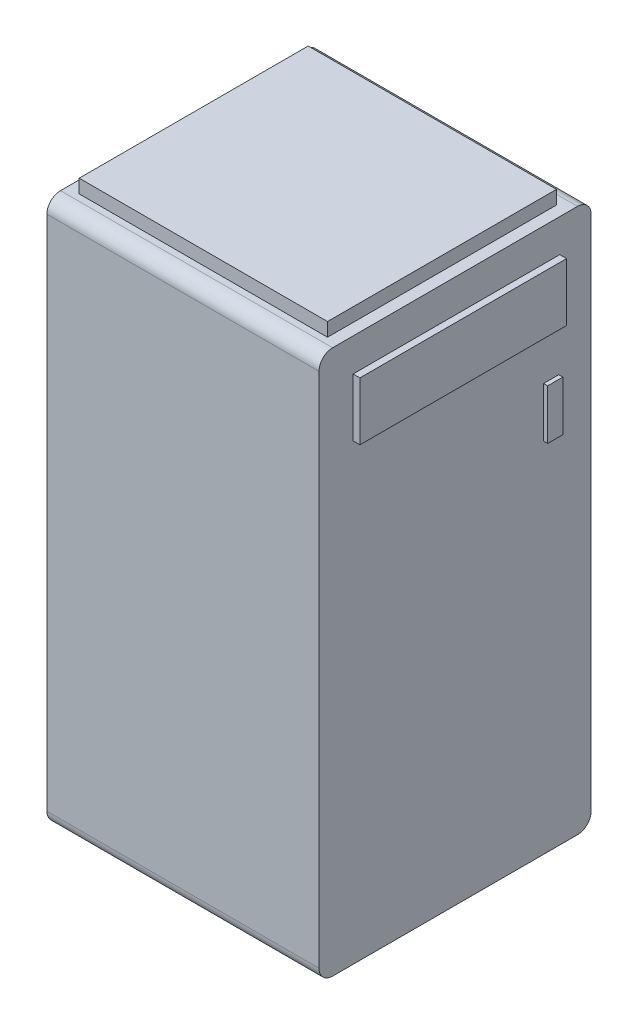
ISO-10303-21;
HEADER;
FILE_DESCRIPTION(('STEP AP214'),'2;1');
FILE_NAME('part.step','',(''),(''),'','','');
FILE_SCHEMA(('AUTOMOTIVE_DESIGN { 1 0 10303 214 1 1 1 1 }'));
ENDSEC;
DATA;
#1=APPLICATION_CONTEXT('core data for automotive mechanical design processes');
#2=APPLICATION_PROTOCOL_DEFINITION('international standard','automotive_design',2000,#1);
#3=PRODUCT_CONTEXT('',#1,'mechanical');
#4=PRODUCT('Part','Part','',(#3));
#5=PRODUCT_RELATED_PRODUCT_CATEGORY('part','',(#4));
#6=PRODUCT_DEFINITION_FORMATION('','',#4);
#7=PRODUCT_DEFINITION_CONTEXT('part definition',#1,'design');
#8=PRODUCT_DEFINITION('design','',#6,#7);
#9=PRODUCT_DEFINITION_SHAPE('','',#8);
#10=(LENGTH_UNIT() NAMED_UNIT(*) SI_UNIT(.MILLI.,.METRE.));
#11=(NAMED_UNIT(*) PLANE_ANGLE_UNIT() SI_UNIT($,.RADIAN.));
#12=(NAMED_UNIT(*) SI_UNIT($,.STERADIAN.) SOLID_ANGLE_UNIT());
#13=UNCERTAINTY_MEASURE_WITH_UNIT(LENGTH_MEASURE(1.E-05),#10,'distance_accuracy_value','');
#14=(GEOMETRIC_REPRESENTATION_CONTEXT(3) GLOBAL_UNCERTAINTY_ASSIGNED_CONTEXT((#13)) GLOBAL_UNIT_ASSIGNED_CONTEXT((#10,
#11,#12)) REPRESENTATION_CONTEXT('',''));
#15=CARTESIAN_POINT('',(0.,0.,0.));
#16=DIRECTION('',(0.,0.,1.));
#17=DIRECTION('',(1.,0.,0.));
#18=AXIS2_PLACEMENT_3D('',#15,#16,#17);
#19=CARTESIAN_POINT('',(-191.055978456742,410.,-14.8091660049622));
#20=DIRECTION('',(1.,0.,0.));
#21=DIRECTION('',(0.,0.,-1.));
#22=AXIS2_PLACEMENT_3D('',#19,#20,#21);
#23=PLANE('',#22);
#24=DIRECTION('',(0.,0.,1.));
#25=VECTOR('',#24,1.);
#26=CARTESIAN_POINT('',(-191.055978456742,400.,-14.8091660049622));
#27=LINE('',#26,#25);
#28=CARTESIAN_POINT('',(-191.055978456742,400.,-183.083294301138));
#29=VERTEX_POINT('',#28);
#30=CARTESIAN_POINT('',(-191.055978456742,400.,-14.8091660049622));
#31=VERTEX_POINT('',#30);
#32=EDGE_CURVE('E106',#29,#31,#27,.T.);
#33=ORIENTED_EDGE('',*,*,#32,.T.);
#34=DIRECTION('',(0.,-1.,0.));
#35=VECTOR('',#34,1.);
#36=CARTESIAN_POINT('',(-191.055978456742,410.,-14.8091660049622));
#37=LINE('',#36,#35);
#38=CARTESIAN_POINT('',(-191.055978456742,410.,-14.8091660049622));
#39=VERTEX_POINT('',#38);
#40=EDGE_CURVE('E12',#39,#31,#37,.T.);
#41=ORIENTED_EDGE('',*,*,#40,.F.);
#42=DIRECTION('',(0.,0.,1.));
#43=VECTOR('',#42,1.);
#44=CARTESIAN_POINT('',(-191.055978456742,410.,-14.8091660049622));
#45=LINE('',#44,#43);
#46=CARTESIAN_POINT('',(-191.055978456742,410.,-183.083294301138));
#47=VERTEX_POINT('',#46);
#48=EDGE_CURVE('E94',#47,#39,#45,.T.);
#49=ORIENTED_EDGE('',*,*,#48,.F.);
#50=DIRECTION('',(0.,-1.,0.));
#51=VECTOR('',#50,1.);
#52=CARTESIAN_POINT('',(-191.055978456742,410.,-183.083294301138));
#53=LINE('',#52,#51);
#54=EDGE_CURVE('E102',#47,#29,#53,.T.);
#55=ORIENTED_EDGE('',*,*,#54,.T.);
#56=EDGE_LOOP('',(#33,#41,#49,#55));
#57=FACE_BOUND('',#56,.T.);
#58=ADVANCED_FACE('F43',(#57),#23,.F.);
#59=CARTESIAN_POINT('',(-8.56084839935853,410.,-14.8091660049622));
#60=DIRECTION('',(0.,0.,-1.));
#61=DIRECTION('',(-1.,0.,0.));
#62=AXIS2_PLACEMENT_3D('',#59,#60,#61);
#63=PLANE('',#62);
#64=DIRECTION('',(1.,0.,0.));
#65=VECTOR('',#64,1.);
#66=CARTESIAN_POINT('',(-8.56084839935853,400.,-14.8091660049622));
#67=LINE('',#66,#65);
#68=CARTESIAN_POINT('',(-8.56084839935853,400.,-14.8091660049622));
#69=VERTEX_POINT('',#68);
#70=EDGE_CURVE('E98',#31,#69,#67,.T.);
#71=ORIENTED_EDGE('',*,*,#70,.T.);
#72=DIRECTION('',(0.,-1.,0.));
#73=VECTOR('',#72,1.);
#74=CARTESIAN_POINT('',(-8.56084839935853,410.,-14.8091660049622));
#75=LINE('',#74,#73);
#76=CARTESIAN_POINT('',(-8.56084839935853,410.,-14.8091660049622));
#77=VERTEX_POINT('',#76);
#78=EDGE_CURVE('E51',#77,#69,#75,.T.);
#79=ORIENTED_EDGE('',*,*,#78,.F.);
#80=DIRECTION('',(1.,0.,0.));
#81=VECTOR('',#80,1.);
#82=CARTESIAN_POINT('',(-8.56084839935853,410.,-14.8091660049622));
#83=LINE('',#82,#81);
#84=EDGE_CURVE('E89',#39,#77,#83,.T.);
#85=ORIENTED_EDGE('',*,*,#84,.F.);
#86=ORIENTED_EDGE('',*,*,#40,.T.);
#87=EDGE_LOOP('',(#71,#79,#85,#86));
#88=FACE_BOUND('',#87,.T.);
#89=ADVANCED_FACE('F97',(#88),#63,.F.);
#90=CARTESIAN_POINT('',(-8.56084839935853,410.,-183.083294301138));
#91=DIRECTION('',(-1.,0.,0.));
#92=DIRECTION('',(0.,0.,1.));
#93=AXIS2_PLACEMENT_3D('',#90,#91,#92);
#94=PLANE('',#93);
#95=DIRECTION('',(0.,0.,-1.));
#96=VECTOR('',#95,1.);
#97=CARTESIAN_POINT('',(-8.56084839935853,400.,-183.083294301138));
#98=LINE('',#97,#96);
#99=CARTESIAN_POINT('',(-8.56084839935853,400.,-183.083294301138));
#100=VERTEX_POINT('',#99);
#101=EDGE_CURVE('E76',#69,#100,#98,.T.);
#102=ORIENTED_EDGE('',*,*,#101,.T.);
#103=DIRECTION('',(0.,-1.,0.));
#104=VECTOR('',#103,1.);
#105=CARTESIAN_POINT('',(-8.56084839935853,410.,-183.083294301138));
#106=LINE('',#105,#104);
#107=CARTESIAN_POINT('',(-8.56084839935853,410.,-183.083294301138));
#108=VERTEX_POINT('',#107);
#109=EDGE_CURVE('E99',#108,#100,#106,.T.);
#110=ORIENTED_EDGE('',*,*,#109,.F.);
#111=DIRECTION('',(0.,0.,-1.));
#112=VECTOR('',#111,1.);
#113=CARTESIAN_POINT('',(-8.56084839935853,410.,-183.083294301138));
#114=LINE('',#113,#112);
#115=EDGE_CURVE('E92',#77,#108,#114,.T.);
#116=ORIENTED_EDGE('',*,*,#115,.F.);
#117=ORIENTED_EDGE('',*,*,#78,.T.);
#118=EDGE_LOOP('',(#102,#110,#116,#117));
#119=FACE_BOUND('',#118,.T.);
#120=ADVANCED_FACE('F100',(#119),#94,.F.);
#121=CARTESIAN_POINT('',(-191.055978456742,410.,-183.083294301138));
#122=DIRECTION('',(0.,0.,1.));
#123=DIRECTION('',(1.,0.,0.));
#124=AXIS2_PLACEMENT_3D('',#121,#122,#123);
#125=PLANE('',#124);
#126=DIRECTION('',(-1.,0.,0.));
#127=VECTOR('',#126,1.);
#128=CARTESIAN_POINT('',(-191.055978456742,400.,-183.083294301138));
#129=LINE('',#128,#127);
#130=EDGE_CURVE('E82',#100,#29,#129,.T.);
#131=ORIENTED_EDGE('',*,*,#130,.T.);
#132=ORIENTED_EDGE('',*,*,#54,.F.);
#133=DIRECTION('',(-1.,0.,0.));
#134=VECTOR('',#133,1.);
#135=CARTESIAN_POINT('',(-191.055978456742,410.,-183.083294301138));
#136=LINE('',#135,#134);
#137=EDGE_CURVE('E59',#108,#47,#136,.T.);
#138=ORIENTED_EDGE('',*,*,#137,.F.);
#139=ORIENTED_EDGE('',*,*,#109,.T.);
#140=EDGE_LOOP('',(#131,#132,#138,#139));
#141=FACE_BOUND('',#140,.T.);
#142=ADVANCED_FACE('F113',(#141),#125,.F.);
#143=CARTESIAN_POINT('',(0.,410.,0.));
#144=DIRECTION('',(0.,-1.,0.));
#145=DIRECTION('',(0.,0.,-1.));
#146=AXIS2_PLACEMENT_3D('',#143,#144,#145);
#147=PLANE('',#146);
#148=ORIENTED_EDGE('',*,*,#48,.T.);
#149=ORIENTED_EDGE('',*,*,#84,.T.);
#150=ORIENTED_EDGE('',*,*,#115,.T.);
#151=ORIENTED_EDGE('',*,*,#137,.T.);
#152=EDGE_LOOP('',(#148,#149,#150,#151));
#153=FACE_BOUND('',#152,.T.);
#154=ADVANCED_FACE('F90',(#153),#147,.F.);
#155=CARTESIAN_POINT('',(0.,400.,0.));
#156=DIRECTION('',(0.,-1.,0.));
#157=DIRECTION('',(0.,0.,-1.));
#158=AXIS2_PLACEMENT_3D('',#155,#156,#157);
#159=PLANE('',#158);
#160=ORIENTED_EDGE('',*,*,#32,.F.);
#161=ORIENTED_EDGE('',*,*,#130,.F.);
#162=ORIENTED_EDGE('',*,*,#101,.F.);
#163=ORIENTED_EDGE('',*,*,#70,.F.);
#164=EDGE_LOOP('',(#160,#161,#162,#163));
#165=FACE_BOUND('',#164,.T.);
#166=ADVANCED_FACE('F116',(#165),#159,.T.);
#167=CLOSED_SHELL('',(#58,#89,#120,#142,#154,#166));
#168=MANIFOLD_SOLID_BREP('B2',#167);
#169=CARTESIAN_POINT('',(0.,400.,0.));
#170=DIRECTION('',(-1.,0.,0.));
#171=DIRECTION('',(0.,0.,1.));
#172=AXIS2_PLACEMENT_3D('',#169,#170,#171);
#173=PLANE('',#172);
#174=DIRECTION('',(0.,-1.,0.));
#175=VECTOR('',#174,1.);
#176=CARTESIAN_POINT('',(0.,375.782116129489,-25.0721801144417));
#177=LINE('',#176,#175);
#178=CARTESIAN_POINT('',(0.,375.782116129489,-25.0721801144417));
#179=VERTEX_POINT('',#178);
#180=CARTESIAN_POINT('',(0.,333.176152062988,-25.0721801144417));
#181=VERTEX_POINT('',#180);
#182=EDGE_CURVE('E405',#179,#181,#177,.T.);
#183=ORIENTED_EDGE('',*,*,#182,.F.);
#184=DIRECTION('',(0.,0.,1.));
#185=VECTOR('',#184,1.);
#186=CARTESIAN_POINT('',(0.,375.782116129489,-25.0721801144417));
#187=LINE('',#186,#185);
#188=CARTESIAN_POINT('',(0.,375.782116129489,-176.962966153307));
#189=VERTEX_POINT('',#188);
#190=EDGE_CURVE('E395',#189,#179,#187,.T.);
#191=ORIENTED_EDGE('',*,*,#190,.F.);
#192=DIRECTION('',(0.,1.,0.));
#193=VECTOR('',#192,1.);
#194=CARTESIAN_POINT('',(0.,375.782116129489,-176.962966153307));
#195=LINE('',#194,#193);
#196=CARTESIAN_POINT('',(0.,333.176152062988,-176.962966153307));
#197=VERTEX_POINT('',#196);
#198=EDGE_CURVE('E399',#197,#189,#195,.T.);
#199=ORIENTED_EDGE('',*,*,#198,.F.);
#200=DIRECTION('',(0.,0.,-1.));
#201=VECTOR('',#200,1.);
#202=CARTESIAN_POINT('',(0.,333.176152062988,-25.0721801144417));
#203=LINE('',#202,#201);
#204=EDGE_CURVE('E402',#181,#197,#203,.T.);
#205=ORIENTED_EDGE('',*,*,#204,.F.);
#206=EDGE_LOOP('',(#183,#191,#199,#205));
#207=FACE_BOUND('',#206,.T.);
#208=DIRECTION('',(0.,0.,-1.));
#209=VECTOR('',#208,1.);
#210=CARTESIAN_POINT('',(0.,0.,0.));
#211=LINE('',#210,#209);
#212=CARTESIAN_POINT('',(0.,0.,-10.));
#213=VERTEX_POINT('',#212);
#214=CARTESIAN_POINT('',(0.,0.,-190.));
#215=VERTEX_POINT('',#214);
#216=EDGE_CURVE('E376',#213,#215,#211,.T.);
#217=ORIENTED_EDGE('',*,*,#216,.T.);
#218=CARTESIAN_POINT('',(0.,10.,-190.));
#219=DIRECTION('',(-1.,0.,0.));
#220=DIRECTION('',(0.,0.,1.));
#221=AXIS2_PLACEMENT_3D('',#218,#219,#220);
#222=CIRCLE('',#221,10.);
#223=CARTESIAN_POINT('',(0.,10.,-200.));
#224=VERTEX_POINT('',#223);
#225=EDGE_CURVE('E315',#215,#224,#222,.F.);
#226=ORIENTED_EDGE('',*,*,#225,.T.);
#227=DIRECTION('',(0.,-1.,0.));
#228=VECTOR('',#227,1.);
#229=CARTESIAN_POINT('',(0.,400.,-200.));
#230=LINE('',#229,#228);
#231=CARTESIAN_POINT('',(0.,390.,-200.));
#232=VERTEX_POINT('',#231);
#233=EDGE_CURVE('E360',#232,#224,#230,.T.);
#234=ORIENTED_EDGE('',*,*,#233,.F.);
#235=CARTESIAN_POINT('',(0.,390.,-190.));
#236=DIRECTION('',(-1.,0.,0.));
#237=DIRECTION('',(0.,0.,1.));
#238=AXIS2_PLACEMENT_3D('',#235,#236,#237);
#239=CIRCLE('',#238,10.);
#240=CARTESIAN_POINT('',(0.,400.,-190.));
#241=VERTEX_POINT('',#240);
#242=EDGE_CURVE('E341',#232,#241,#239,.F.);
#243=ORIENTED_EDGE('',*,*,#242,.T.);
#244=DIRECTION('',(0.,0.,-1.));
#245=VECTOR('',#244,1.);
#246=CARTESIAN_POINT('',(0.,400.,0.));
#247=LINE('',#246,#245);
#248=CARTESIAN_POINT('',(0.,400.,-10.));
#249=VERTEX_POINT('',#248);
#250=EDGE_CURVE('E375',#249,#241,#247,.T.);
#251=ORIENTED_EDGE('',*,*,#250,.F.);
#252=CARTESIAN_POINT('',(0.,390.,-10.));
#253=DIRECTION('',(-1.,0.,0.));
#254=DIRECTION('',(0.,0.,1.));
#255=AXIS2_PLACEMENT_3D('',#252,#253,#254);
#256=CIRCLE('',#255,10.);
#257=CARTESIAN_POINT('',(0.,390.,0.));
#258=VERTEX_POINT('',#257);
#259=EDGE_CURVE('E355',#249,#258,#256,.F.);
#260=ORIENTED_EDGE('',*,*,#259,.T.);
#261=DIRECTION('',(0.,-1.,0.));
#262=VECTOR('',#261,1.);
#263=CARTESIAN_POINT('',(0.,400.,0.));
#264=LINE('',#263,#262);
#265=CARTESIAN_POINT('',(0.,10.,0.));
#266=VERTEX_POINT('',#265);
#267=EDGE_CURVE('E369',#258,#266,#264,.T.);
#268=ORIENTED_EDGE('',*,*,#267,.T.);
#269=CARTESIAN_POINT('',(0.,10.,-10.));
#270=DIRECTION('',(-1.,0.,0.));
#271=DIRECTION('',(0.,0.,1.));
#272=AXIS2_PLACEMENT_3D('',#269,#270,#271);
#273=CIRCLE('',#272,10.);
#274=EDGE_CURVE('E336',#266,#213,#273,.F.);
#275=ORIENTED_EDGE('',*,*,#274,.T.);
#276=EDGE_LOOP('',(#217,#226,#234,#243,#251,#260,#268,#275));
#277=FACE_BOUND('',#276,.T.);
#278=DIRECTION('',(0.,-1.,0.));
#279=VECTOR('',#278,1.);
#280=CARTESIAN_POINT('',(0.,263.02065383153,-165.070356943589));
#281=LINE('',#280,#279);
#282=CARTESIAN_POINT('',(0.,299.716628665272,-165.070356943589));
#283=VERTEX_POINT('',#282);
#284=CARTESIAN_POINT('',(0.,263.02065383153,-165.070356943589));
#285=VERTEX_POINT('',#284);
#286=EDGE_CURVE('E438',#283,#285,#281,.T.);
#287=ORIENTED_EDGE('',*,*,#286,.F.);
#288=DIRECTION('',(0.,0.,1.));
#289=VECTOR('',#288,1.);
#290=CARTESIAN_POINT('',(0.,299.716628665272,-165.070356943589));
#291=LINE('',#290,#289);
#292=CARTESIAN_POINT('',(0.,299.716628665272,-176.24824555006));
#293=VERTEX_POINT('',#292);
#294=EDGE_CURVE('E428',#293,#283,#291,.T.);
#295=ORIENTED_EDGE('',*,*,#294,.F.);
#296=DIRECTION('',(0.,1.,0.));
#297=VECTOR('',#296,1.);
#298=CARTESIAN_POINT('',(0.,299.716628665272,-176.24824555006));
#299=LINE('',#298,#297);
#300=CARTESIAN_POINT('',(0.,263.02065383153,-176.24824555006));
#301=VERTEX_POINT('',#300);
#302=EDGE_CURVE('E432',#301,#293,#299,.T.);
#303=ORIENTED_EDGE('',*,*,#302,.F.);
#304=DIRECTION('',(0.,0.,-1.));
#305=VECTOR('',#304,1.);
#306=CARTESIAN_POINT('',(0.,263.02065383153,-176.24824555006));
#307=LINE('',#306,#305);
#308=EDGE_CURVE('E435',#285,#301,#307,.T.);
#309=ORIENTED_EDGE('',*,*,#308,.F.);
#310=EDGE_LOOP('',(#287,#295,#303,#309));
#311=FACE_BOUND('',#310,.T.);
#312=ADVANCED_FACE('F167',(#207,#277,#311),#173,.F.);
#313=CARTESIAN_POINT('',(0.,400.,-200.));
#314=DIRECTION('',(0.,0.,1.));
#315=DIRECTION('',(1.,0.,0.));
#316=AXIS2_PLACEMENT_3D('',#313,#314,#315);
#317=PLANE('',#316);
#318=ORIENTED_EDGE('',*,*,#233,.T.);
#319=DIRECTION('',(-1.,0.,0.));
#320=VECTOR('',#319,1.);
#321=CARTESIAN_POINT('',(0.,10.,-200.));
#322=LINE('',#321,#320);
#323=CARTESIAN_POINT('',(-200.,10.,-200.));
#324=VERTEX_POINT('',#323);
#325=EDGE_CURVE('E328',#224,#324,#322,.T.);
#326=ORIENTED_EDGE('',*,*,#325,.T.);
#327=DIRECTION('',(0.,-1.,0.));
#328=VECTOR('',#327,1.);
#329=CARTESIAN_POINT('',(-200.,400.,-200.));
#330=LINE('',#329,#328);
#331=CARTESIAN_POINT('',(-200.,390.,-200.));
#332=VERTEX_POINT('',#331);
#333=EDGE_CURVE('E363',#332,#324,#330,.T.);
#334=ORIENTED_EDGE('',*,*,#333,.F.);
#335=DIRECTION('',(-1.,0.,0.));
#336=VECTOR('',#335,1.);
#337=CARTESIAN_POINT('',(0.,390.,-200.));
#338=LINE('',#337,#336);
#339=EDGE_CURVE('E343',#332,#232,#338,.F.);
#340=ORIENTED_EDGE('',*,*,#339,.T.);
#341=EDGE_LOOP('',(#318,#326,#334,#340));
#342=FACE_BOUND('',#341,.T.);
#343=ADVANCED_FACE('F478',(#342),#317,.F.);
#344=CARTESIAN_POINT('',(-200.,400.,0.));
#345=DIRECTION('',(1.,0.,0.));
#346=DIRECTION('',(0.,0.,-1.));
#347=AXIS2_PLACEMENT_3D('',#344,#345,#346);
#348=PLANE('',#347);
#349=ORIENTED_EDGE('',*,*,#333,.T.);
#350=CARTESIAN_POINT('',(-200.,10.,-190.));
#351=DIRECTION('',(1.,0.,0.));
#352=DIRECTION('',(0.,0.,-1.));
#353=AXIS2_PLACEMENT_3D('',#350,#351,#352);
#354=CIRCLE('',#353,10.);
#355=CARTESIAN_POINT('',(-200.,0.,-190.));
#356=VERTEX_POINT('',#355);
#357=EDGE_CURVE('E326',#324,#356,#354,.F.);
#358=ORIENTED_EDGE('',*,*,#357,.T.);
#359=DIRECTION('',(0.,0.,1.));
#360=VECTOR('',#359,1.);
#361=CARTESIAN_POINT('',(-200.,0.,0.));
#362=LINE('',#361,#360);
#363=CARTESIAN_POINT('',(-200.,0.,-9.99999999999998));
#364=VERTEX_POINT('',#363);
#365=EDGE_CURVE('E373',#356,#364,#362,.T.);
#366=ORIENTED_EDGE('',*,*,#365,.T.);
#367=CARTESIAN_POINT('',(-200.,10.,-9.99999999999998));
#368=DIRECTION('',(1.,0.,0.));
#369=DIRECTION('',(0.,0.,-1.));
#370=AXIS2_PLACEMENT_3D('',#367,#368,#369);
#371=CIRCLE('',#370,10.);
#372=CARTESIAN_POINT('',(-200.,10.,0.));
#373=VERTEX_POINT('',#372);
#374=EDGE_CURVE('E331',#364,#373,#371,.F.);
#375=ORIENTED_EDGE('',*,*,#374,.T.);
#376=DIRECTION('',(0.,-1.,0.));
#377=VECTOR('',#376,1.);
#378=CARTESIAN_POINT('',(-200.,400.,0.));
#379=LINE('',#378,#377);
#380=CARTESIAN_POINT('',(-200.,390.,0.));
#381=VERTEX_POINT('',#380);
#382=EDGE_CURVE('E366',#381,#373,#379,.T.);
#383=ORIENTED_EDGE('',*,*,#382,.F.);
#384=CARTESIAN_POINT('',(-200.,390.,-9.99999999999998));
#385=DIRECTION('',(1.,0.,0.));
#386=DIRECTION('',(0.,0.,-1.));
#387=AXIS2_PLACEMENT_3D('',#384,#385,#386);
#388=CIRCLE('',#387,10.);
#389=CARTESIAN_POINT('',(-200.,400.,-9.99999999999998));
#390=VERTEX_POINT('',#389);
#391=EDGE_CURVE('E350',#381,#390,#388,.F.);
#392=ORIENTED_EDGE('',*,*,#391,.T.);
#393=DIRECTION('',(0.,0.,1.));
#394=VECTOR('',#393,1.);
#395=CARTESIAN_POINT('',(-200.,400.,0.));
#396=LINE('',#395,#394);
#397=CARTESIAN_POINT('',(-200.,400.,-190.));
#398=VERTEX_POINT('',#397);
#399=EDGE_CURVE('E372',#398,#390,#396,.T.);
#400=ORIENTED_EDGE('',*,*,#399,.F.);
#401=CARTESIAN_POINT('',(-200.,390.,-190.));
#402=DIRECTION('',(1.,0.,0.));
#403=DIRECTION('',(0.,0.,-1.));
#404=AXIS2_PLACEMENT_3D('',#401,#402,#403);
#405=CIRCLE('',#404,10.);
#406=EDGE_CURVE('E345',#398,#332,#405,.F.);
#407=ORIENTED_EDGE('',*,*,#406,.T.);
#408=EDGE_LOOP('',(#349,#358,#366,#375,#383,#392,#400,#407));
#409=FACE_BOUND('',#408,.T.);
#410=ADVANCED_FACE('F484',(#409),#348,.F.);
#411=CARTESIAN_POINT('',(0.,400.,0.));
#412=DIRECTION('',(0.,0.,-1.));
#413=DIRECTION('',(-1.,0.,0.));
#414=AXIS2_PLACEMENT_3D('',#411,#412,#413);
#415=PLANE('',#414);
#416=ORIENTED_EDGE('',*,*,#382,.T.);
#417=DIRECTION('',(1.,0.,0.));
#418=VECTOR('',#417,1.);
#419=CARTESIAN_POINT('',(0.,10.,0.));
#420=LINE('',#419,#418);
#421=EDGE_CURVE('E338',#373,#266,#420,.T.);
#422=ORIENTED_EDGE('',*,*,#421,.T.);
#423=ORIENTED_EDGE('',*,*,#267,.F.);
#424=DIRECTION('',(1.,0.,0.));
#425=VECTOR('',#424,1.);
#426=CARTESIAN_POINT('',(-200.,390.,0.));
#427=LINE('',#426,#425);
#428=EDGE_CURVE('E353',#258,#381,#427,.F.);
#429=ORIENTED_EDGE('',*,*,#428,.T.);
#430=EDGE_LOOP('',(#416,#422,#423,#429));
#431=FACE_BOUND('',#430,.T.);
#432=ADVANCED_FACE('F513',(#431),#415,.F.);
#433=CARTESIAN_POINT('',(0.,400.,0.));
#434=DIRECTION('',(0.,1.,0.));
#435=DIRECTION('',(0.,0.,1.));
#436=AXIS2_PLACEMENT_3D('',#433,#434,#435);
#437=PLANE('',#436);
#438=DIRECTION('',(0.,0.,1.));
#439=VECTOR('',#438,1.);
#440=CARTESIAN_POINT('',(-191.055978456742,400.,-14.8091660049622));
#441=LINE('',#440,#439);
#442=CARTESIAN_POINT('',(-191.055978456742,400.,-183.083294301138));
#443=VERTEX_POINT('',#442);
#444=CARTESIAN_POINT('',(-191.055978456742,400.,-14.8091660049622));
#445=VERTEX_POINT('',#444);
#446=EDGE_CURVE('E190',#443,#445,#441,.T.);
#447=ORIENTED_EDGE('',*,*,#446,.F.);
#448=DIRECTION('',(-1.,0.,0.));
#449=VECTOR('',#448,1.);
#450=CARTESIAN_POINT('',(-191.055978456742,400.,-183.083294301138));
#451=LINE('',#450,#449);
#452=CARTESIAN_POINT('',(-8.56084839935853,400.,-183.083294301138));
#453=VERTEX_POINT('',#452);
#454=EDGE_CURVE('E307',#453,#443,#451,.T.);
#455=ORIENTED_EDGE('',*,*,#454,.F.);
#456=DIRECTION('',(0.,0.,-1.));
#457=VECTOR('',#456,1.);
#458=CARTESIAN_POINT('',(-8.56084839935853,400.,-183.083294301138));
#459=LINE('',#458,#457);
#460=CARTESIAN_POINT('',(-8.56084839935853,400.,-14.8091660049622));
#461=VERTEX_POINT('',#460);
#462=EDGE_CURVE('E455',#461,#453,#459,.T.);
#463=ORIENTED_EDGE('',*,*,#462,.F.);
#464=DIRECTION('',(1.,0.,0.));
#465=VECTOR('',#464,1.);
#466=CARTESIAN_POINT('',(-8.56084839935853,400.,-14.8091660049622));
#467=LINE('',#466,#465);
#468=EDGE_CURVE('E458',#445,#461,#467,.T.);
#469=ORIENTED_EDGE('',*,*,#468,.F.);
#470=EDGE_LOOP('',(#447,#455,#463,#469));
#471=FACE_BOUND('',#470,.T.);
#472=ORIENTED_EDGE('',*,*,#250,.T.);
#473=DIRECTION('',(-1.,0.,0.));
#474=VECTOR('',#473,1.);
#475=CARTESIAN_POINT('',(-200.,400.,-190.));
#476=LINE('',#475,#474);
#477=EDGE_CURVE('E347',#241,#398,#476,.T.);
#478=ORIENTED_EDGE('',*,*,#477,.T.);
#479=ORIENTED_EDGE('',*,*,#399,.T.);
#480=DIRECTION('',(1.,0.,0.));
#481=VECTOR('',#480,1.);
#482=CARTESIAN_POINT('',(0.,400.,-10.));
#483=LINE('',#482,#481);
#484=EDGE_CURVE('E357',#390,#249,#483,.T.);
#485=ORIENTED_EDGE('',*,*,#484,.T.);
#486=EDGE_LOOP('',(#472,#478,#479,#485));
#487=FACE_BOUND('',#486,.T.);
#488=ADVANCED_FACE('F463',(#471,#487),#437,.T.);
#489=CARTESIAN_POINT('',(0.,0.,0.));
#490=DIRECTION('',(0.,1.,0.));
#491=DIRECTION('',(0.,0.,1.));
#492=AXIS2_PLACEMENT_3D('',#489,#490,#491);
#493=PLANE('',#492);
#494=DIRECTION('',(-1.,0.,0.));
#495=VECTOR('',#494,1.);
#496=CARTESIAN_POINT('',(0.,0.,-183.083294301138));
#497=LINE('',#496,#495);
#498=CARTESIAN_POINT('',(-8.56084839935853,0.,-183.083294301138));
#499=VERTEX_POINT('',#498);
#500=CARTESIAN_POINT('',(-191.055978456742,0.,-183.083294301138));
#501=VERTEX_POINT('',#500);
#502=EDGE_CURVE('E175',#499,#501,#497,.T.);
#503=ORIENTED_EDGE('',*,*,#502,.T.);
#504=DIRECTION('',(0.,0.,1.));
#505=VECTOR('',#504,1.);
#506=CARTESIAN_POINT('',(-191.055978456742,0.,0.));
#507=LINE('',#506,#505);
#508=CARTESIAN_POINT('',(-191.055978456742,0.,-14.8091660049622));
#509=VERTEX_POINT('',#508);
#510=EDGE_CURVE('E41',#501,#509,#507,.T.);
#511=ORIENTED_EDGE('',*,*,#510,.T.);
#512=DIRECTION('',(1.,0.,0.));
#513=VECTOR('',#512,1.);
#514=CARTESIAN_POINT('',(0.,0.,-14.8091660049622));
#515=LINE('',#514,#513);
#516=CARTESIAN_POINT('',(-8.56084839935853,0.,-14.8091660049622));
#517=VERTEX_POINT('',#516);
#518=EDGE_CURVE('E310',#509,#517,#515,.T.);
#519=ORIENTED_EDGE('',*,*,#518,.T.);
#520=DIRECTION('',(0.,0.,-1.));
#521=VECTOR('',#520,1.);
#522=CARTESIAN_POINT('',(-8.56084839935853,0.,0.));
#523=LINE('',#522,#521);
#524=EDGE_CURVE('E314',#517,#499,#523,.T.);
#525=ORIENTED_EDGE('',*,*,#524,.T.);
#526=EDGE_LOOP('',(#503,#511,#519,#525));
#527=FACE_BOUND('',#526,.T.);
#528=ORIENTED_EDGE('',*,*,#365,.F.);
#529=DIRECTION('',(-1.,0.,0.));
#530=VECTOR('',#529,1.);
#531=CARTESIAN_POINT('',(0.,0.,-190.));
#532=LINE('',#531,#530);
#533=EDGE_CURVE('E324',#356,#215,#532,.F.);
#534=ORIENTED_EDGE('',*,*,#533,.T.);
#535=ORIENTED_EDGE('',*,*,#216,.F.);
#536=DIRECTION('',(1.,0.,0.));
#537=VECTOR('',#536,1.);
#538=CARTESIAN_POINT('',(0.,0.,-10.));
#539=LINE('',#538,#537);
#540=EDGE_CURVE('E333',#213,#364,#539,.F.);
#541=ORIENTED_EDGE('',*,*,#540,.T.);
#542=EDGE_LOOP('',(#528,#534,#535,#541));
#543=FACE_BOUND('',#542,.T.);
#544=ADVANCED_FACE('F317',(#527,#543),#493,.F.);
#545=CARTESIAN_POINT('',(0.,390.,-10.));
#546=DIRECTION('',(-1.,0.,0.));
#547=DIRECTION('',(0.,0.,1.));
#548=AXIS2_PLACEMENT_3D('',#545,#546,#547);
#549=CYLINDRICAL_SURFACE('',#548,10.);
#550=ORIENTED_EDGE('',*,*,#391,.F.);
#551=ORIENTED_EDGE('',*,*,#428,.F.);
#552=ORIENTED_EDGE('',*,*,#259,.F.);
#553=ORIENTED_EDGE('',*,*,#484,.F.);
#554=EDGE_LOOP('',(#550,#551,#552,#553));
#555=FACE_BOUND('',#554,.T.);
#556=ADVANCED_FACE('F490',(#555),#549,.T.);
#557=CARTESIAN_POINT('',(0.,390.,-190.));
#558=DIRECTION('',(1.,0.,0.));
#559=DIRECTION('',(0.,0.,-1.));
#560=AXIS2_PLACEMENT_3D('',#557,#558,#559);
#561=CYLINDRICAL_SURFACE('',#560,10.);
#562=ORIENTED_EDGE('',*,*,#242,.F.);
#563=ORIENTED_EDGE('',*,*,#339,.F.);
#564=ORIENTED_EDGE('',*,*,#406,.F.);
#565=ORIENTED_EDGE('',*,*,#477,.F.);
#566=EDGE_LOOP('',(#562,#563,#564,#565));
#567=FACE_BOUND('',#566,.T.);
#568=ADVANCED_FACE('F493',(#567),#561,.T.);
#569=CARTESIAN_POINT('',(0.,10.,-10.));
#570=DIRECTION('',(1.,0.,0.));
#571=DIRECTION('',(0.,0.,-1.));
#572=AXIS2_PLACEMENT_3D('',#569,#570,#571);
#573=CYLINDRICAL_SURFACE('',#572,10.);
#574=ORIENTED_EDGE('',*,*,#374,.F.);
#575=ORIENTED_EDGE('',*,*,#540,.F.);
#576=ORIENTED_EDGE('',*,*,#274,.F.);
#577=ORIENTED_EDGE('',*,*,#421,.F.);
#578=EDGE_LOOP('',(#574,#575,#576,#577));
#579=FACE_BOUND('',#578,.T.);
#580=ADVANCED_FACE('F496',(#579),#573,.T.);
#581=CARTESIAN_POINT('',(0.,10.,-190.));
#582=DIRECTION('',(-1.,0.,0.));
#583=DIRECTION('',(0.,0.,1.));
#584=AXIS2_PLACEMENT_3D('',#581,#582,#583);
#585=CYLINDRICAL_SURFACE('',#584,10.);
#586=ORIENTED_EDGE('',*,*,#225,.F.);
#587=ORIENTED_EDGE('',*,*,#533,.F.);
#588=ORIENTED_EDGE('',*,*,#357,.F.);
#589=ORIENTED_EDGE('',*,*,#325,.F.);
#590=EDGE_LOOP('',(#586,#587,#588,#589));
#591=FACE_BOUND('',#590,.T.);
#592=ADVANCED_FACE('F169',(#591),#585,.T.);
#593=CARTESIAN_POINT('',(5.,375.782116129489,-25.0721801144417));
#594=DIRECTION('',(0.,0.,-1.));
#595=DIRECTION('',(-1.,0.,0.));
#596=AXIS2_PLACEMENT_3D('',#593,#594,#595);
#597=PLANE('',#596);
#598=ORIENTED_EDGE('',*,*,#182,.T.);
#599=DIRECTION('',(-1.,0.,0.));
#600=VECTOR('',#599,1.);
#601=CARTESIAN_POINT('',(5.,333.176152062988,-25.0721801144417));
#602=LINE('',#601,#600);
#603=CARTESIAN_POINT('',(5.,333.176152062988,-25.0721801144417));
#604=VERTEX_POINT('',#603);
#605=EDGE_CURVE('E379',#604,#181,#602,.T.);
#606=ORIENTED_EDGE('',*,*,#605,.F.);
#607=DIRECTION('',(0.,-1.,0.));
#608=VECTOR('',#607,1.);
#609=CARTESIAN_POINT('',(5.,375.782116129489,-25.0721801144417));
#610=LINE('',#609,#608);
#611=CARTESIAN_POINT('',(5.,375.782116129489,-25.0721801144417));
#612=VERTEX_POINT('',#611);
#613=EDGE_CURVE('E398',#612,#604,#610,.T.);
#614=ORIENTED_EDGE('',*,*,#613,.F.);
#615=DIRECTION('',(-1.,0.,0.));
#616=VECTOR('',#615,1.);
#617=CARTESIAN_POINT('',(5.,375.782116129489,-25.0721801144417));
#618=LINE('',#617,#616);
#619=EDGE_CURVE('E391',#612,#179,#618,.T.);
#620=ORIENTED_EDGE('',*,*,#619,.T.);
#621=EDGE_LOOP('',(#598,#606,#614,#620));
#622=FACE_BOUND('',#621,.T.);
#623=ADVANCED_FACE('F503',(#622),#597,.F.);
#624=CARTESIAN_POINT('',(5.,333.176152062988,-25.0721801144417));
#625=DIRECTION('',(0.,1.,0.));
#626=DIRECTION('',(0.,0.,1.));
#627=AXIS2_PLACEMENT_3D('',#624,#625,#626);
#628=PLANE('',#627);
#629=ORIENTED_EDGE('',*,*,#204,.T.);
#630=DIRECTION('',(-1.,0.,0.));
#631=VECTOR('',#630,1.);
#632=CARTESIAN_POINT('',(5.,333.176152062988,-176.962966153307));
#633=LINE('',#632,#631);
#634=CARTESIAN_POINT('',(5.,333.176152062988,-176.962966153307));
#635=VERTEX_POINT('',#634);
#636=EDGE_CURVE('E385',#635,#197,#633,.T.);
#637=ORIENTED_EDGE('',*,*,#636,.F.);
#638=DIRECTION('',(0.,0.,-1.));
#639=VECTOR('',#638,1.);
#640=CARTESIAN_POINT('',(5.,333.176152062988,-25.0721801144417));
#641=LINE('',#640,#639);
#642=EDGE_CURVE('E412',#604,#635,#641,.T.);
#643=ORIENTED_EDGE('',*,*,#642,.F.);
#644=ORIENTED_EDGE('',*,*,#605,.T.);
#645=EDGE_LOOP('',(#629,#637,#643,#644));
#646=FACE_BOUND('',#645,.T.);
#647=ADVANCED_FACE('F671',(#646),#628,.F.);
#648=CARTESIAN_POINT('',(5.,375.782116129489,-176.962966153307));
#649=DIRECTION('',(0.,0.,1.));
#650=DIRECTION('',(1.,0.,0.));
#651=AXIS2_PLACEMENT_3D('',#648,#649,#650);
#652=PLANE('',#651);
#653=ORIENTED_EDGE('',*,*,#198,.T.);
#654=DIRECTION('',(-1.,0.,0.));
#655=VECTOR('',#654,1.);
#656=CARTESIAN_POINT('',(5.,375.782116129489,-176.962966153307));
#657=LINE('',#656,#655);
#658=CARTESIAN_POINT('',(5.,375.782116129489,-176.962966153307));
#659=VERTEX_POINT('',#658);
#660=EDGE_CURVE('E388',#659,#189,#657,.T.);
#661=ORIENTED_EDGE('',*,*,#660,.F.);
#662=DIRECTION('',(0.,1.,0.));
#663=VECTOR('',#662,1.);
#664=CARTESIAN_POINT('',(5.,375.782116129489,-176.962966153307));
#665=LINE('',#664,#663);
#666=EDGE_CURVE('E410',#635,#659,#665,.T.);
#667=ORIENTED_EDGE('',*,*,#666,.F.);
#668=ORIENTED_EDGE('',*,*,#636,.T.);
#669=EDGE_LOOP('',(#653,#661,#667,#668));
#670=FACE_BOUND('',#669,.T.);
#671=ADVANCED_FACE('F662',(#670),#652,.F.);
#672=CARTESIAN_POINT('',(5.,375.782116129489,-25.0721801144417));
#673=DIRECTION('',(0.,-1.,0.));
#674=DIRECTION('',(0.,0.,-1.));
#675=AXIS2_PLACEMENT_3D('',#672,#673,#674);
#676=PLANE('',#675);
#677=ORIENTED_EDGE('',*,*,#190,.T.);
#678=ORIENTED_EDGE('',*,*,#619,.F.);
#679=DIRECTION('',(0.,0.,1.));
#680=VECTOR('',#679,1.);
#681=CARTESIAN_POINT('',(5.,375.782116129489,-25.0721801144417));
#682=LINE('',#681,#680);
#683=EDGE_CURVE('E394',#659,#612,#682,.T.);
#684=ORIENTED_EDGE('',*,*,#683,.F.);
#685=ORIENTED_EDGE('',*,*,#660,.T.);
#686=EDGE_LOOP('',(#677,#678,#684,#685));
#687=FACE_BOUND('',#686,.T.);
#688=ADVANCED_FACE('F653',(#687),#676,.F.);
#689=CARTESIAN_POINT('',(5.,0.,0.));
#690=DIRECTION('',(1.,0.,0.));
#691=DIRECTION('',(0.,0.,-1.));
#692=AXIS2_PLACEMENT_3D('',#689,#690,#691);
#693=PLANE('',#692);
#694=ORIENTED_EDGE('',*,*,#613,.T.);
#695=ORIENTED_EDGE('',*,*,#642,.T.);
#696=ORIENTED_EDGE('',*,*,#666,.T.);
#697=ORIENTED_EDGE('',*,*,#683,.T.);
#698=EDGE_LOOP('',(#694,#695,#696,#697));
#699=FACE_BOUND('',#698,.T.);
#700=ADVANCED_FACE('F640',(#699),#693,.T.);
#701=CARTESIAN_POINT('',(3.,263.02065383153,-165.070356943589));
#702=DIRECTION('',(0.,0.,-1.));
#703=DIRECTION('',(-1.,0.,0.));
#704=AXIS2_PLACEMENT_3D('',#701,#702,#703);
#705=PLANE('',#704);
#706=ORIENTED_EDGE('',*,*,#286,.T.);
#707=DIRECTION('',(-1.,0.,0.));
#708=VECTOR('',#707,1.);
#709=CARTESIAN_POINT('',(3.,263.02065383153,-165.070356943589));
#710=LINE('',#709,#708);
#711=CARTESIAN_POINT('',(3.,263.02065383153,-165.070356943589));
#712=VERTEX_POINT('',#711);
#713=EDGE_CURVE('E408',#712,#285,#710,.T.);
#714=ORIENTED_EDGE('',*,*,#713,.F.);
#715=DIRECTION('',(0.,-1.,0.));
#716=VECTOR('',#715,1.);
#717=CARTESIAN_POINT('',(3.,263.02065383153,-165.070356943589));
#718=LINE('',#717,#716);
#719=CARTESIAN_POINT('',(3.,299.716628665272,-165.070356943589));
#720=VERTEX_POINT('',#719);
#721=EDGE_CURVE('E431',#720,#712,#718,.T.);
#722=ORIENTED_EDGE('',*,*,#721,.F.);
#723=DIRECTION('',(-1.,0.,0.));
#724=VECTOR('',#723,1.);
#725=CARTESIAN_POINT('',(3.,299.716628665272,-165.070356943589));
#726=LINE('',#725,#724);
#727=EDGE_CURVE('E424',#720,#283,#726,.T.);
#728=ORIENTED_EDGE('',*,*,#727,.T.);
#729=EDGE_LOOP('',(#706,#714,#722,#728));
#730=FACE_BOUND('',#729,.T.);
#731=ADVANCED_FACE('F631',(#730),#705,.F.);
#732=CARTESIAN_POINT('',(3.,263.02065383153,-176.24824555006));
#733=DIRECTION('',(0.,1.,0.));
#734=DIRECTION('',(0.,0.,1.));
#735=AXIS2_PLACEMENT_3D('',#732,#733,#734);
#736=PLANE('',#735);
#737=ORIENTED_EDGE('',*,*,#308,.T.);
#738=DIRECTION('',(-1.,0.,0.));
#739=VECTOR('',#738,1.);
#740=CARTESIAN_POINT('',(3.,263.02065383153,-176.24824555006));
#741=LINE('',#740,#739);
#742=CARTESIAN_POINT('',(3.,263.02065383153,-176.24824555006));
#743=VERTEX_POINT('',#742);
#744=EDGE_CURVE('E418',#743,#301,#741,.T.);
#745=ORIENTED_EDGE('',*,*,#744,.F.);
#746=DIRECTION('',(0.,0.,-1.));
#747=VECTOR('',#746,1.);
#748=CARTESIAN_POINT('',(3.,263.02065383153,-176.24824555006));
#749=LINE('',#748,#747);
#750=EDGE_CURVE('E445',#712,#743,#749,.T.);
#751=ORIENTED_EDGE('',*,*,#750,.F.);
#752=ORIENTED_EDGE('',*,*,#713,.T.);
#753=EDGE_LOOP('',(#737,#745,#751,#752));
#754=FACE_BOUND('',#753,.T.);
#755=ADVANCED_FACE('F622',(#754),#736,.F.);
#756=CARTESIAN_POINT('',(3.,299.716628665272,-176.24824555006));
#757=DIRECTION('',(0.,0.,1.));
#758=DIRECTION('',(1.,0.,0.));
#759=AXIS2_PLACEMENT_3D('',#756,#757,#758);
#760=PLANE('',#759);
#761=ORIENTED_EDGE('',*,*,#302,.T.);
#762=DIRECTION('',(-1.,0.,0.));
#763=VECTOR('',#762,1.);
#764=CARTESIAN_POINT('',(3.,299.716628665272,-176.24824555006));
#765=LINE('',#764,#763);
#766=CARTESIAN_POINT('',(3.,299.716628665272,-176.24824555006));
#767=VERTEX_POINT('',#766);
#768=EDGE_CURVE('E421',#767,#293,#765,.T.);
#769=ORIENTED_EDGE('',*,*,#768,.F.);
#770=DIRECTION('',(0.,1.,0.));
#771=VECTOR('',#770,1.);
#772=CARTESIAN_POINT('',(3.,299.716628665272,-176.24824555006));
#773=LINE('',#772,#771);
#774=EDGE_CURVE('E443',#743,#767,#773,.T.);
#775=ORIENTED_EDGE('',*,*,#774,.F.);
#776=ORIENTED_EDGE('',*,*,#744,.T.);
#777=EDGE_LOOP('',(#761,#769,#775,#776));
#778=FACE_BOUND('',#777,.T.);
#779=ADVANCED_FACE('F613',(#778),#760,.F.);
#780=CARTESIAN_POINT('',(3.,299.716628665272,-165.070356943589));
#781=DIRECTION('',(0.,-1.,0.));
#782=DIRECTION('',(0.,0.,-1.));
#783=AXIS2_PLACEMENT_3D('',#780,#781,#782);
#784=PLANE('',#783);
#785=ORIENTED_EDGE('',*,*,#294,.T.);
#786=ORIENTED_EDGE('',*,*,#727,.F.);
#787=DIRECTION('',(0.,0.,1.));
#788=VECTOR('',#787,1.);
#789=CARTESIAN_POINT('',(3.,299.716628665272,-165.070356943589));
#790=LINE('',#789,#788);
#791=EDGE_CURVE('E427',#767,#720,#790,.T.);
#792=ORIENTED_EDGE('',*,*,#791,.F.);
#793=ORIENTED_EDGE('',*,*,#768,.T.);
#794=EDGE_LOOP('',(#785,#786,#792,#793));
#795=FACE_BOUND('',#794,.T.);
#796=ADVANCED_FACE('F606',(#795),#784,.F.);
#797=CARTESIAN_POINT('',(3.,0.,0.));
#798=DIRECTION('',(-1.,0.,0.));
#799=DIRECTION('',(0.,0.,1.));
#800=AXIS2_PLACEMENT_3D('',#797,#798,#799);
#801=PLANE('',#800);
#802=ORIENTED_EDGE('',*,*,#721,.T.);
#803=ORIENTED_EDGE('',*,*,#750,.T.);
#804=ORIENTED_EDGE('',*,*,#774,.T.);
#805=ORIENTED_EDGE('',*,*,#791,.T.);
#806=EDGE_LOOP('',(#802,#803,#804,#805));
#807=FACE_BOUND('',#806,.T.);
#808=ADVANCED_FACE('F475',(#807),#801,.F.);
#809=CARTESIAN_POINT('',(-191.055978456742,50.,-14.8091660049622));
#810=DIRECTION('',(-1.,0.,0.));
#811=DIRECTION('',(0.,0.,1.));
#812=AXIS2_PLACEMENT_3D('',#809,#810,#811);
#813=PLANE('',#812);
#814=ORIENTED_EDGE('',*,*,#446,.T.);
#815=DIRECTION('',(0.,1.,0.));
#816=VECTOR('',#815,1.);
#817=CARTESIAN_POINT('',(-191.055978456742,50.,-14.8091660049622));
#818=LINE('',#817,#816);
#819=EDGE_CURVE('E303',#509,#445,#818,.T.);
#820=ORIENTED_EDGE('',*,*,#819,.F.);
#821=ORIENTED_EDGE('',*,*,#510,.F.);
#822=DIRECTION('',(0.,1.,0.));
#823=VECTOR('',#822,1.);
#824=CARTESIAN_POINT('',(-191.055978456742,50.,-183.083294301138));
#825=LINE('',#824,#823);
#826=EDGE_CURVE('E441',#501,#443,#825,.T.);
#827=ORIENTED_EDGE('',*,*,#826,.T.);
#828=EDGE_LOOP('',(#814,#820,#821,#827));
#829=FACE_BOUND('',#828,.T.);
#830=ADVANCED_FACE('F304',(#829),#813,.F.);
#831=CARTESIAN_POINT('',(-191.055978456742,50.,-183.083294301138));
#832=DIRECTION('',(0.,0.,-1.));
#833=DIRECTION('',(-1.,0.,0.));
#834=AXIS2_PLACEMENT_3D('',#831,#832,#833);
#835=PLANE('',#834);
#836=ORIENTED_EDGE('',*,*,#454,.T.);
#837=ORIENTED_EDGE('',*,*,#826,.F.);
#838=ORIENTED_EDGE('',*,*,#502,.F.);
#839=DIRECTION('',(0.,1.,0.));
#840=VECTOR('',#839,1.);
#841=CARTESIAN_POINT('',(-8.56084839935853,50.,-183.083294301138));
#842=LINE('',#841,#840);
#843=EDGE_CURVE('E450',#499,#453,#842,.T.);
#844=ORIENTED_EDGE('',*,*,#843,.T.);
#845=EDGE_LOOP('',(#836,#837,#838,#844));
#846=FACE_BOUND('',#845,.T.);
#847=ADVANCED_FACE('F467',(#846),#835,.F.);
#848=CARTESIAN_POINT('',(-8.56084839935853,50.,-183.083294301138));
#849=DIRECTION('',(1.,0.,0.));
#850=DIRECTION('',(0.,0.,-1.));
#851=AXIS2_PLACEMENT_3D('',#848,#849,#850);
#852=PLANE('',#851);
#853=ORIENTED_EDGE('',*,*,#462,.T.);
#854=ORIENTED_EDGE('',*,*,#843,.F.);
#855=ORIENTED_EDGE('',*,*,#524,.F.);
#856=DIRECTION('',(0.,1.,0.));
#857=VECTOR('',#856,1.);
#858=CARTESIAN_POINT('',(-8.56084839935853,50.,-14.8091660049622));
#859=LINE('',#858,#857);
#860=EDGE_CURVE('E182',#517,#461,#859,.T.);
#861=ORIENTED_EDGE('',*,*,#860,.T.);
#862=EDGE_LOOP('',(#853,#854,#855,#861));
#863=FACE_BOUND('',#862,.T.);
#864=ADVANCED_FACE('F466',(#863),#852,.F.);
#865=CARTESIAN_POINT('',(-8.56084839935853,50.,-14.8091660049622));
#866=DIRECTION('',(0.,0.,1.));
#867=DIRECTION('',(1.,0.,0.));
#868=AXIS2_PLACEMENT_3D('',#865,#866,#867);
#869=PLANE('',#868);
#870=ORIENTED_EDGE('',*,*,#468,.T.);
#871=ORIENTED_EDGE('',*,*,#860,.F.);
#872=ORIENTED_EDGE('',*,*,#518,.F.);
#873=ORIENTED_EDGE('',*,*,#819,.T.);
#874=EDGE_LOOP('',(#870,#871,#872,#873));
#875=FACE_BOUND('',#874,.T.);
#876=ADVANCED_FACE('F311',(#875),#869,.F.);
#877=CLOSED_SHELL('',(#312,#343,#410,#432,#488,#544,#556,#568,#580,#592,#623,#647,#671,#688,
#700,#731,#755,#779,#796,#808,#830,#847,#864,#876));
#878=MANIFOLD_SOLID_BREP('B6',#877);
#879=ADVANCED_BREP_SHAPE_REPRESENTATION('',(#18,#168,#878),#14);
#880=SHAPE_DEFINITION_REPRESENTATION(#9,#879);
ENDSEC;
END-ISO-10303-21;
